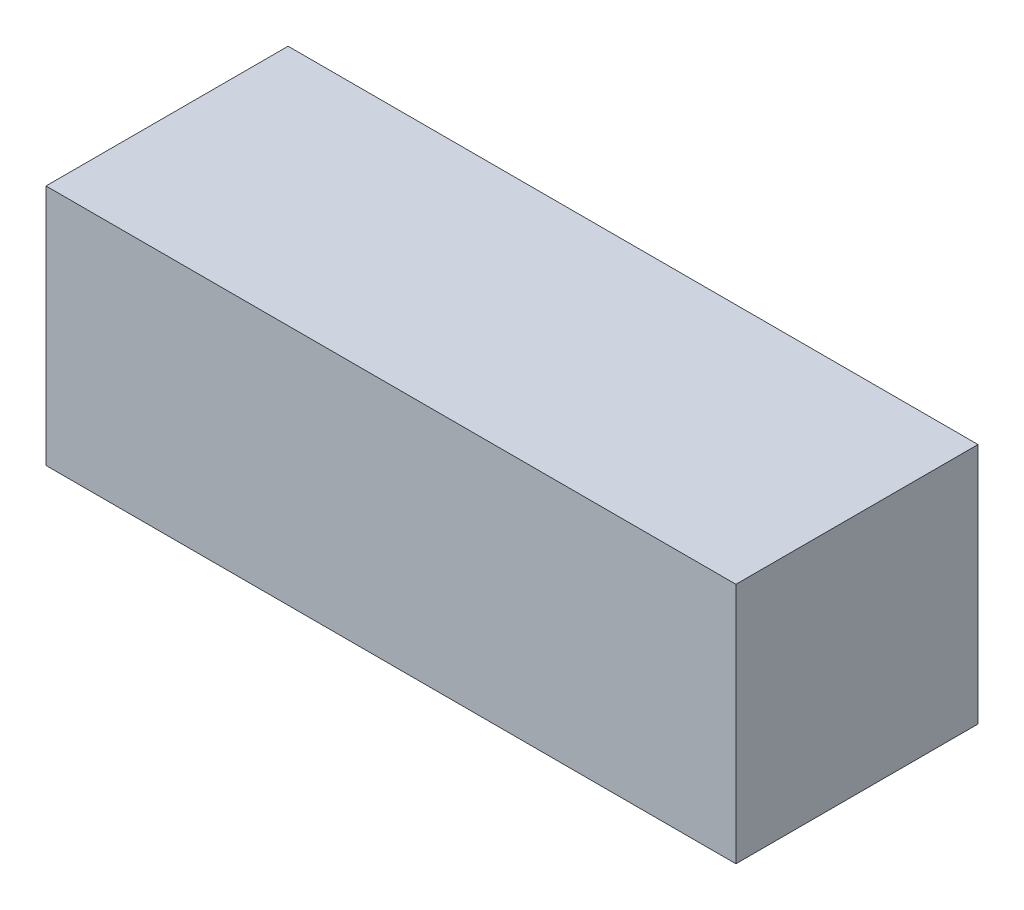
ISO-10303-21;
HEADER;
FILE_DESCRIPTION(('STEP AP214'),'2;1');
FILE_NAME('part.step','',(''),(''),'','','');
FILE_SCHEMA(('AUTOMOTIVE_DESIGN { 1 0 10303 214 1 1 1 1 }'));
ENDSEC;
DATA;
#1=APPLICATION_CONTEXT('core data for automotive mechanical design processes');
#2=APPLICATION_PROTOCOL_DEFINITION('international standard','automotive_design',2000,#1);
#3=PRODUCT_CONTEXT('',#1,'mechanical');
#4=PRODUCT('Part','Part','',(#3));
#5=PRODUCT_RELATED_PRODUCT_CATEGORY('part','',(#4));
#6=PRODUCT_DEFINITION_FORMATION('','',#4);
#7=PRODUCT_DEFINITION_CONTEXT('part definition',#1,'design');
#8=PRODUCT_DEFINITION('design','',#6,#7);
#9=PRODUCT_DEFINITION_SHAPE('','',#8);
#10=(LENGTH_UNIT() NAMED_UNIT(*) SI_UNIT(.MILLI.,.METRE.));
#11=(NAMED_UNIT(*) PLANE_ANGLE_UNIT() SI_UNIT($,.RADIAN.));
#12=(NAMED_UNIT(*) SI_UNIT($,.STERADIAN.) SOLID_ANGLE_UNIT());
#13=UNCERTAINTY_MEASURE_WITH_UNIT(LENGTH_MEASURE(1.E-05),#10,'distance_accuracy_value','');
#14=(GEOMETRIC_REPRESENTATION_CONTEXT(3) GLOBAL_UNCERTAINTY_ASSIGNED_CONTEXT((#13)) GLOBAL_UNIT_ASSIGNED_CONTEXT((#10,
#11,#12)) REPRESENTATION_CONTEXT('',''));
#15=CARTESIAN_POINT('',(0.,0.,0.));
#16=DIRECTION('',(0.,0.,1.));
#17=DIRECTION('',(1.,0.,0.));
#18=AXIS2_PLACEMENT_3D('',#15,#16,#17);
#19=CARTESIAN_POINT('',(74.9989954719027,-93.6999995455148,9.99999809152268));
#20=DIRECTION('',(0.,-1.,0.));
#21=DIRECTION('',(0.,0.,-1.));
#22=AXIS2_PLACEMENT_3D('',#19,#20,#21);
#23=PLANE('',#22);
#24=DIRECTION('',(1.,0.,-4.79255768693432E-09));
#25=VECTOR('',#24,1.);
#26=CARTESIAN_POINT('',(74.9989955198283,-93.6999995455181,19.9999980915227));
#27=LINE('',#26,#25);
#28=CARTESIAN_POINT('',(-14.2499999999997,-93.6999995455181,19.9999984511537));
#29=VERTEX_POINT('',#28);
#30=CARTESIAN_POINT('',(14.25,-93.6999995455189,19.999998382681));
#31=VERTEX_POINT('',#30);
#32=EDGE_CURVE('E20',#29,#31,#27,.T.);
#33=ORIENTED_EDGE('',*,*,#32,.F.);
#34=DIRECTION('',(0.,0.,1.));
#35=VECTOR('',#34,1.);
#36=CARTESIAN_POINT('',(-14.2499999999995,-93.6999995455248,11.9999999999998));
#37=LINE('',#36,#35);
#38=CARTESIAN_POINT('',(-14.2499999999996,-93.6999995455189,9.99999851927845));
#39=VERTEX_POINT('',#38);
#40=EDGE_CURVE('E80',#39,#29,#37,.T.);
#41=ORIENTED_EDGE('',*,*,#40,.F.);
#42=DIRECTION('',(-1.,0.,4.79255768693432E-09));
#43=VECTOR('',#42,1.);
#44=CARTESIAN_POINT('',(74.9989954719027,-93.6999995455181,9.99999809152268));
#45=LINE('',#44,#43);
#46=CARTESIAN_POINT('',(14.25,-93.6999995455206,9.99999841653688));
#47=VERTEX_POINT('',#46);
#48=EDGE_CURVE('E68',#47,#39,#45,.T.);
#49=ORIENTED_EDGE('',*,*,#48,.F.);
#50=DIRECTION('',(0.,0.,1.));
#51=VECTOR('',#50,1.);
#52=CARTESIAN_POINT('',(14.25,-93.6999995455248,12.));
#53=LINE('',#52,#51);
#54=EDGE_CURVE('E55',#31,#47,#53,.F.);
#55=ORIENTED_EDGE('',*,*,#54,.F.);
#56=EDGE_LOOP('',(#33,#41,#49,#55));
#57=FACE_BOUND('',#56,.T.);
#58=ADVANCED_FACE('F17',(#57),#23,.T.);
#59=CARTESIAN_POINT('',(74.9989955198283,-93.6999995455148,19.9999980915227));
#60=DIRECTION('',(4.79255768693432E-09,0.,1.));
#61=DIRECTION('',(1.,0.,-4.79255768693432E-09));
#62=AXIS2_PLACEMENT_3D('',#59,#60,#61);
#63=PLANE('',#62);
#64=DIRECTION('',(1.,0.,0.));
#65=VECTOR('',#64,1.);
#66=CARTESIAN_POINT('',(74.9989955198283,-83.6999995455148,19.9999985192536));
#67=LINE('',#66,#65);
#68=CARTESIAN_POINT('',(-14.2499999999996,-83.6999995455148,19.9999985194173));
#69=VERTEX_POINT('',#68);
#70=CARTESIAN_POINT('',(14.25,-83.6999995455148,19.9999984168127));
#71=VERTEX_POINT('',#70);
#72=EDGE_CURVE('E83',#69,#71,#67,.T.);
#73=ORIENTED_EDGE('',*,*,#72,.F.);
#74=DIRECTION('',(0.,1.,0.));
#75=VECTOR('',#74,1.);
#76=CARTESIAN_POINT('',(-14.2499999999997,-33.4535583778433,19.9999985199082));
#77=LINE('',#76,#75);
#78=EDGE_CURVE('E64',#29,#69,#77,.T.);
#79=ORIENTED_EDGE('',*,*,#78,.F.);
#80=ORIENTED_EDGE('',*,*,#32,.T.);
#81=DIRECTION('',(0.,1.,0.));
#82=VECTOR('',#81,1.);
#83=CARTESIAN_POINT('',(14.25,-33.4535583778433,19.9999983826658));
#84=LINE('',#83,#82);
#85=EDGE_CURVE('E61',#71,#31,#84,.F.);
#86=ORIENTED_EDGE('',*,*,#85,.F.);
#87=EDGE_LOOP('',(#73,#79,#80,#86));
#88=FACE_BOUND('',#87,.T.);
#89=ADVANCED_FACE('F60',(#88),#63,.T.);
#90=CARTESIAN_POINT('',(14.25,-33.4535583778433,12.));
#91=DIRECTION('',(1.,0.,0.));
#92=DIRECTION('',(0.,1.,0.));
#93=AXIS2_PLACEMENT_3D('',#90,#91,#92);
#94=PLANE('',#93);
#95=ORIENTED_EDGE('',*,*,#54,.T.);
#96=DIRECTION('',(0.,1.,0.));
#97=VECTOR('',#96,1.);
#98=CARTESIAN_POINT('',(14.25,-83.6999995455148,9.99999838266575));
#99=LINE('',#98,#97);
#100=CARTESIAN_POINT('',(14.25,-83.6999995455148,9.9999983823651));
#101=VERTEX_POINT('',#100);
#102=EDGE_CURVE('E70',#101,#47,#99,.F.);
#103=ORIENTED_EDGE('',*,*,#102,.F.);
#104=DIRECTION('',(0.,0.,1.));
#105=VECTOR('',#104,1.);
#106=CARTESIAN_POINT('',(14.25,-83.6999995455148,19.9999980915227));
#107=LINE('',#106,#105);
#108=EDGE_CURVE('E74',#71,#101,#107,.F.);
#109=ORIENTED_EDGE('',*,*,#108,.F.);
#110=ORIENTED_EDGE('',*,*,#85,.T.);
#111=EDGE_LOOP('',(#95,#103,#109,#110));
#112=FACE_BOUND('',#111,.T.);
#113=ADVANCED_FACE('F72',(#112),#94,.T.);
#114=CARTESIAN_POINT('',(74.9989954719027,-83.6999995455148,9.99999809152268));
#115=DIRECTION('',(-4.79255768693432E-09,0.,-1.));
#116=DIRECTION('',(-1.,0.,4.79255768693432E-09));
#117=AXIS2_PLACEMENT_3D('',#114,#115,#116);
#118=PLANE('',#117);
#119=ORIENTED_EDGE('',*,*,#48,.T.);
#120=DIRECTION('',(0.,1.,0.));
#121=VECTOR('',#120,1.);
#122=CARTESIAN_POINT('',(-14.2499999999995,-33.4535583778433,9.99999851925364));
#123=LINE('',#122,#121);
#124=CARTESIAN_POINT('',(-14.2499999999995,-83.6999995455148,9.99999848510667));
#125=VERTEX_POINT('',#124);
#126=EDGE_CURVE('E35',#125,#39,#123,.F.);
#127=ORIENTED_EDGE('',*,*,#126,.F.);
#128=DIRECTION('',(1.,0.,0.));
#129=VECTOR('',#128,1.);
#130=CARTESIAN_POINT('',(74.9989955198283,-83.6999995455148,9.99999838266574));
#131=LINE('',#130,#129);
#132=EDGE_CURVE('E26',#101,#125,#131,.F.);
#133=ORIENTED_EDGE('',*,*,#132,.F.);
#134=ORIENTED_EDGE('',*,*,#102,.T.);
#135=EDGE_LOOP('',(#119,#127,#133,#134));
#136=FACE_BOUND('',#135,.T.);
#137=ADVANCED_FACE('F89',(#136),#118,.T.);
#138=CARTESIAN_POINT('',(-14.2499999999995,-33.4535583778433,11.9999999999998));
#139=DIRECTION('',(-1.,0.,0.));
#140=DIRECTION('',(0.,0.,1.));
#141=AXIS2_PLACEMENT_3D('',#138,#139,#140);
#142=PLANE('',#141);
#143=ORIENTED_EDGE('',*,*,#40,.T.);
#144=ORIENTED_EDGE('',*,*,#78,.T.);
#145=DIRECTION('',(0.,0.,1.));
#146=VECTOR('',#145,1.);
#147=CARTESIAN_POINT('',(-14.2499999999994,-83.6999995455148,19.9999980915227));
#148=LINE('',#147,#146);
#149=EDGE_CURVE('E11',#125,#69,#148,.T.);
#150=ORIENTED_EDGE('',*,*,#149,.F.);
#151=ORIENTED_EDGE('',*,*,#126,.T.);
#152=EDGE_LOOP('',(#143,#144,#150,#151));
#153=FACE_BOUND('',#152,.T.);
#154=ADVANCED_FACE('F91',(#153),#142,.T.);
#155=CARTESIAN_POINT('',(74.9989955198283,-83.6999995455148,19.9999980915227));
#156=DIRECTION('',(0.,1.,0.));
#157=DIRECTION('',(0.,0.,1.));
#158=AXIS2_PLACEMENT_3D('',#155,#156,#157);
#159=PLANE('',#158);
#160=ORIENTED_EDGE('',*,*,#132,.T.);
#161=ORIENTED_EDGE('',*,*,#149,.T.);
#162=ORIENTED_EDGE('',*,*,#72,.T.);
#163=ORIENTED_EDGE('',*,*,#108,.T.);
#164=EDGE_LOOP('',(#160,#161,#162,#163));
#165=FACE_BOUND('',#164,.T.);
#166=ADVANCED_FACE('F88',(#165),#159,.T.);
#167=CLOSED_SHELL('',(#58,#89,#113,#137,#154,#166));
#168=MANIFOLD_SOLID_BREP('B1',#167);
#169=ADVANCED_BREP_SHAPE_REPRESENTATION('',(#18,#168),#14);
#170=SHAPE_DEFINITION_REPRESENTATION(#9,#169);
ENDSEC;
END-ISO-10303-21;
